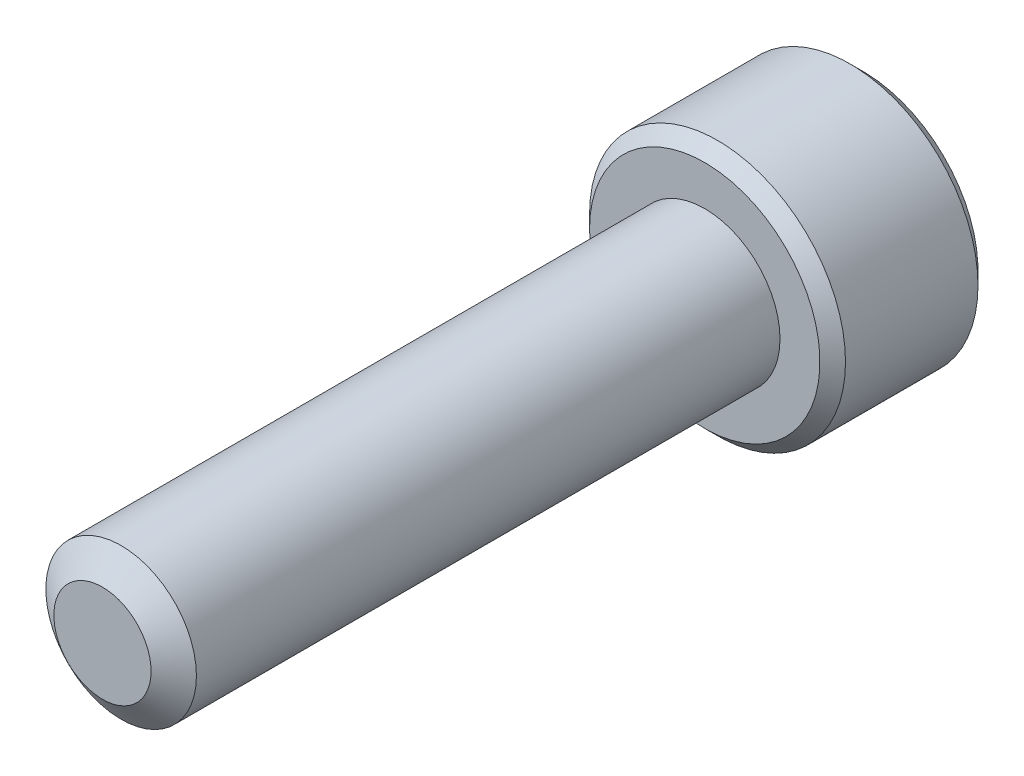
ISO-10303-21;
HEADER;
FILE_DESCRIPTION(('STEP AP214'),'2;1');
FILE_NAME('part.step','',(''),(''),'','','');
FILE_SCHEMA(('AUTOMOTIVE_DESIGN { 1 0 10303 214 1 1 1 1 }'));
ENDSEC;
DATA;
#1=APPLICATION_CONTEXT('core data for automotive mechanical design processes');
#2=APPLICATION_PROTOCOL_DEFINITION('international standard','automotive_design',2000,#1);
#3=PRODUCT_CONTEXT('',#1,'mechanical');
#4=PRODUCT('Part','Part','',(#3));
#5=PRODUCT_RELATED_PRODUCT_CATEGORY('part','',(#4));
#6=PRODUCT_DEFINITION_FORMATION('','',#4);
#7=PRODUCT_DEFINITION_CONTEXT('part definition',#1,'design');
#8=PRODUCT_DEFINITION('design','',#6,#7);
#9=PRODUCT_DEFINITION_SHAPE('','',#8);
#10=(LENGTH_UNIT() NAMED_UNIT(*) SI_UNIT(.MILLI.,.METRE.));
#11=(NAMED_UNIT(*) PLANE_ANGLE_UNIT() SI_UNIT($,.RADIAN.));
#12=(NAMED_UNIT(*) SI_UNIT($,.STERADIAN.) SOLID_ANGLE_UNIT());
#13=UNCERTAINTY_MEASURE_WITH_UNIT(LENGTH_MEASURE(1.E-05),#10,'distance_accuracy_value','');
#14=(GEOMETRIC_REPRESENTATION_CONTEXT(3) GLOBAL_UNCERTAINTY_ASSIGNED_CONTEXT((#13)) GLOBAL_UNIT_ASSIGNED_CONTEXT((#10,
#11,#12)) REPRESENTATION_CONTEXT('',''));
#15=CARTESIAN_POINT('',(0.,0.,0.));
#16=DIRECTION('',(0.,0.,1.));
#17=DIRECTION('',(1.,0.,0.));
#18=AXIS2_PLACEMENT_3D('',#15,#16,#17);
#19=CARTESIAN_POINT('',(0.,0.,-16.));
#20=DIRECTION('',(0.,0.,1.));
#21=DIRECTION('',(1.,0.,0.));
#22=AXIS2_PLACEMENT_3D('',#19,#20,#21);
#23=CYLINDRICAL_SURFACE('',#22,2.);
#24=CARTESIAN_POINT('',(0.,0.,-16.));
#25=DIRECTION('',(0.,0.,-1.));
#26=DIRECTION('',(-1.,0.,0.));
#27=AXIS2_PLACEMENT_3D('',#24,#25,#26);
#28=CIRCLE('',#27,2.);
#29=CARTESIAN_POINT('',(-2.,0.,-16.));
#30=VERTEX_POINT('',#29);
#31=EDGE_CURVE('E231',#30,#30,#28,.F.);
#32=ORIENTED_EDGE('',*,*,#31,.T.);
#33=EDGE_LOOP('',(#32));
#34=FACE_BOUND('',#33,.T.);
#35=CARTESIAN_POINT('',(0.,0.,-0.496211410611025));
#36=DIRECTION('',(0.,0.,1.));
#37=DIRECTION('',(1.,0.,0.));
#38=AXIS2_PLACEMENT_3D('',#35,#36,#37);
#39=CIRCLE('',#38,2.);
#40=CARTESIAN_POINT('',(2.,0.,-0.496211410611025));
#41=VERTEX_POINT('',#40);
#42=EDGE_CURVE('E116',#41,#41,#39,.T.);
#43=ORIENTED_EDGE('',*,*,#42,.F.);
#44=EDGE_LOOP('',(#43));
#45=FACE_BOUND('',#44,.T.);
#46=ADVANCED_FACE('F39',(#34,#45),#23,.T.);
#47=CARTESIAN_POINT('',(0.,0.,0.));
#48=DIRECTION('',(0.,0.,-1.));
#49=DIRECTION('',(-1.,0.,0.));
#50=AXIS2_PLACEMENT_3D('',#47,#48,#49);
#51=CONICAL_SURFACE('',#50,1.29133666301317,0.959931088596884);
#52=ORIENTED_EDGE('',*,*,#42,.T.);
#53=EDGE_LOOP('',(#52));
#54=FACE_BOUND('',#53,.T.);
#55=CARTESIAN_POINT('',(0.,0.,0.));
#56=DIRECTION('',(0.,0.,1.));
#57=DIRECTION('',(1.,0.,0.));
#58=AXIS2_PLACEMENT_3D('',#55,#56,#57);
#59=CIRCLE('',#58,1.29133666301317);
#60=CARTESIAN_POINT('',(1.29133666301317,0.,0.));
#61=VERTEX_POINT('',#60);
#62=EDGE_CURVE('E228',#61,#61,#59,.T.);
#63=ORIENTED_EDGE('',*,*,#62,.F.);
#64=EDGE_LOOP('',(#63));
#65=FACE_BOUND('',#64,.T.);
#66=ADVANCED_FACE('F211',(#54,#65),#51,.T.);
#67=CARTESIAN_POINT('',(0.,0.,0.));
#68=DIRECTION('',(0.,0.,1.));
#69=DIRECTION('',(1.,0.,0.));
#70=AXIS2_PLACEMENT_3D('',#67,#68,#69);
#71=PLANE('',#70);
#72=ORIENTED_EDGE('',*,*,#62,.T.);
#73=EDGE_LOOP('',(#72));
#74=FACE_BOUND('',#73,.T.);
#75=ADVANCED_FACE('F208',(#74),#71,.T.);
#76=CARTESIAN_POINT('',(0.,0.,-20.2));
#77=DIRECTION('',(0.,0.,1.));
#78=DIRECTION('',(1.,0.,0.));
#79=AXIS2_PLACEMENT_3D('',#76,#77,#78);
#80=CYLINDRICAL_SURFACE('',#79,3.4);
#81=CARTESIAN_POINT('',(0.,0.,-19.86));
#82=DIRECTION('',(0.,0.,-1.));
#83=DIRECTION('',(-1.,0.,0.));
#84=AXIS2_PLACEMENT_3D('',#81,#82,#83);
#85=CIRCLE('',#84,3.4);
#86=CARTESIAN_POINT('',(-3.4,0.,-19.86));
#87=VERTEX_POINT('',#86);
#88=EDGE_CURVE('E48',#87,#87,#85,.F.);
#89=ORIENTED_EDGE('',*,*,#88,.T.);
#90=EDGE_LOOP('',(#89));
#91=FACE_BOUND('',#90,.T.);
#92=CARTESIAN_POINT('',(0.,0.,-16.34));
#93=DIRECTION('',(0.,0.,-1.));
#94=DIRECTION('',(-1.,0.,0.));
#95=AXIS2_PLACEMENT_3D('',#92,#93,#94);
#96=CIRCLE('',#95,3.4);
#97=CARTESIAN_POINT('',(-3.4,0.,-16.34));
#98=VERTEX_POINT('',#97);
#99=EDGE_CURVE('E185',#98,#98,#96,.T.);
#100=ORIENTED_EDGE('',*,*,#99,.T.);
#101=EDGE_LOOP('',(#100));
#102=FACE_BOUND('',#101,.T.);
#103=ADVANCED_FACE('F192',(#91,#102),#80,.T.);
#104=CARTESIAN_POINT('',(0.,0.,-20.2));
#105=DIRECTION('',(0.,0.,-1.));
#106=DIRECTION('',(-1.,0.,0.));
#107=AXIS2_PLACEMENT_3D('',#104,#105,#106);
#108=PLANE('',#107);
#109=CARTESIAN_POINT('',(0.,0.,-20.2));
#110=DIRECTION('',(0.,0.,-1.));
#111=DIRECTION('',(-1.,0.,0.));
#112=AXIS2_PLACEMENT_3D('',#109,#110,#111);
#113=CIRCLE('',#112,3.06);
#114=CARTESIAN_POINT('',(-3.06,0.,-20.2));
#115=VERTEX_POINT('',#114);
#116=EDGE_CURVE('E115',#115,#115,#113,.T.);
#117=ORIENTED_EDGE('',*,*,#116,.T.);
#118=EDGE_LOOP('',(#117));
#119=FACE_BOUND('',#118,.T.);
#120=CARTESIAN_POINT('',(0.,0.,-20.2));
#121=DIRECTION('',(0.,0.,-1.));
#122=DIRECTION('',(-1.,0.,0.));
#123=AXIS2_PLACEMENT_3D('',#120,#121,#122);
#124=CIRCLE('',#123,2.06222299276169);
#125=CARTESIAN_POINT('',(-1.7859375,1.03111149638085,-20.2));
#126=VERTEX_POINT('',#125);
#127=CARTESIAN_POINT('',(0.,2.06222299276169,-20.2));
#128=VERTEX_POINT('',#127);
#129=EDGE_CURVE('E94',#126,#128,#124,.T.);
#130=ORIENTED_EDGE('',*,*,#129,.F.);
#131=CARTESIAN_POINT('',(-1.7859375,-1.03111149638085,-20.2));
#132=VERTEX_POINT('',#131);
#133=EDGE_CURVE('E54',#132,#126,#124,.T.);
#134=ORIENTED_EDGE('',*,*,#133,.F.);
#135=CARTESIAN_POINT('',(0.,-2.06222299276169,-20.2));
#136=VERTEX_POINT('',#135);
#137=EDGE_CURVE('E304',#136,#132,#124,.T.);
#138=ORIENTED_EDGE('',*,*,#137,.F.);
#139=CARTESIAN_POINT('',(1.7859375,-1.03111149638085,-20.2));
#140=VERTEX_POINT('',#139);
#141=EDGE_CURVE('E61',#140,#136,#124,.T.);
#142=ORIENTED_EDGE('',*,*,#141,.F.);
#143=CARTESIAN_POINT('',(1.7859375,1.03111149638085,-20.2));
#144=VERTEX_POINT('',#143);
#145=EDGE_CURVE('E139',#144,#140,#124,.T.);
#146=ORIENTED_EDGE('',*,*,#145,.F.);
#147=EDGE_CURVE('E104',#128,#144,#124,.T.);
#148=ORIENTED_EDGE('',*,*,#147,.F.);
#149=EDGE_LOOP('',(#130,#134,#138,#142,#146,#148));
#150=FACE_BOUND('',#149,.T.);
#151=ADVANCED_FACE('F138',(#119,#150),#108,.T.);
#152=CARTESIAN_POINT('',(0.,0.,-16.));
#153=DIRECTION('',(0.,0.,-1.));
#154=DIRECTION('',(-1.,0.,0.));
#155=AXIS2_PLACEMENT_3D('',#152,#153,#154);
#156=PLANE('',#155);
#157=CARTESIAN_POINT('',(0.,0.,-16.));
#158=DIRECTION('',(0.,0.,-1.));
#159=DIRECTION('',(-1.,0.,0.));
#160=AXIS2_PLACEMENT_3D('',#157,#158,#159);
#161=CIRCLE('',#160,3.06);
#162=CARTESIAN_POINT('',(-3.06,0.,-16.));
#163=VERTEX_POINT('',#162);
#164=EDGE_CURVE('E11',#163,#163,#161,.F.);
#165=ORIENTED_EDGE('',*,*,#164,.T.);
#166=EDGE_LOOP('',(#165));
#167=FACE_BOUND('',#166,.T.);
#168=ORIENTED_EDGE('',*,*,#31,.F.);
#169=EDGE_LOOP('',(#168));
#170=FACE_BOUND('',#169,.T.);
#171=ADVANCED_FACE('F201',(#167,#170),#156,.F.);
#172=CARTESIAN_POINT('',(0.,0.,-20.2));
#173=DIRECTION('',(0.,0.,-1.));
#174=DIRECTION('',(-1.,0.,0.));
#175=AXIS2_PLACEMENT_3D('',#172,#173,#174);
#176=CONICAL_SURFACE('',#175,2.06222299276169,0.78539816339745);
#177=ORIENTED_EDGE('',*,*,#147,.T.);
#178=CARTESIAN_POINT('',(-0.000200000000000017,2.06233846281553,-20.2001154797516));
#179=CARTESIAN_POINT('',(0.0611956015759164,2.02689169571862,-20.1646968302053));
#180=CARTESIAN_POINT('',(0.123617860874082,1.9908521875094,-20.1313581781509));
#181=CARTESIAN_POINT('',(0.250903960535891,1.91736352360555,-20.0703155592055));
#182=CARTESIAN_POINT('',(0.315779909798269,1.87990737683499,-20.0426455621251));
#183=CARTESIAN_POINT('',(0.446599209311714,1.8043788190457,-19.9952461265528));
#184=CARTESIAN_POINT('',(0.512509233513534,1.76632564883049,-19.9753975342861));
#185=CARTESIAN_POINT('',(0.645780477682402,1.68938146013435,-19.9448164816143));
#186=CARTESIAN_POINT('',(0.713137624857635,1.65049279308089,-19.9340611886412));
#187=CARTESIAN_POINT('',(0.829220820670577,1.58347212872989,-19.9243572559589));
#188=CARTESIAN_POINT('',(0.877796848686671,1.55542674587864,-19.922920545453));
#189=CARTESIAN_POINT('',(0.974869540343765,1.49938180121945,-19.9253394477888));
#190=CARTESIAN_POINT('',(1.02336617019129,1.4713822589222,-19.9291969161715));
#191=CARTESIAN_POINT('',(1.11988817846821,1.4156552514608,-19.9419828827439));
#192=CARTESIAN_POINT('',(1.16791312509815,1.38792803559618,-19.9509156537155));
#193=CARTESIAN_POINT('',(1.26315922323818,1.33293767519577,-19.9733673141422));
#194=CARTESIAN_POINT('',(1.31037998091306,1.30567475804084,-19.986888386438));
#195=CARTESIAN_POINT('',(1.43132294865621,1.23584830305774,-20.0270273746341));
#196=CARTESIAN_POINT('',(1.50429529371242,1.19371769999614,-20.0566707839069));
#197=CARTESIAN_POINT('',(1.61159442773943,1.13176851608183,-20.106713490254));
#198=CARTESIAN_POINT('',(1.64695424171411,1.11135351796506,-20.124296283774));
#199=CARTESIAN_POINT('',(1.71701878052223,1.07090173762354,-20.1610647691481));
#200=CARTESIAN_POINT('',(1.75172389195438,1.05086473219594,-20.180249476289));
#201=CARTESIAN_POINT('',(1.7861375,1.03099602632701,-20.2001154797516));
#202=B_SPLINE_CURVE_WITH_KNOTS('',3,(#178,#179,#180,#181,#182,#183,#184,#185,#186,#187,#188,
#189,#190,#191,#192,#193,#194,#195,#196,#197,#198,#199,#200,#201),.UNSPECIFIED.,.F.,.F.,(4,2,2,
2,2,2,2,2,2,2,2,4),(0.,0.237911140423802,0.47720876767363,0.712705150046278,0.947608448198473,
1.11569769827263,1.28384587649986,1.45213582505427,1.62050594845156,1.88791495712909,
2.02125696737758,2.15451760593925),.UNSPECIFIED.);
#203=EDGE_CURVE('E109',#128,#144,#202,.T.);
#204=ORIENTED_EDGE('',*,*,#203,.F.);
#205=EDGE_LOOP('',(#177,#204));
#206=FACE_BOUND('',#205,.T.);
#207=ADVANCED_FACE('F110',(#206),#176,.F.);
#208=ORIENTED_EDGE('',*,*,#145,.T.);
#209=CARTESIAN_POINT('',(1.7859375,-2.05645717971961,-20.8614856711608));
#210=CARTESIAN_POINT('',(1.7859375,-2.00638471938943,-20.8236880172129));
#211=CARTESIAN_POINT('',(1.7859375,-1.95603188921789,-20.7862564488772));
#212=CARTESIAN_POINT('',(1.7859375,-1.854654932589,-20.7122876155155));
#213=CARTESIAN_POINT('',(1.7859375,-1.80363064078787,-20.6757505773471));
#214=CARTESIAN_POINT('',(1.7859375,-1.70042696280105,-20.6034731530224));
#215=CARTESIAN_POINT('',(1.7859375,-1.64824168990499,-20.5677411330885));
#216=CARTESIAN_POINT('',(1.7859375,-1.54298521945367,-20.4976166562004));
#217=CARTESIAN_POINT('',(1.7859375,-1.4899140848692,-20.4632241046057));
#218=CARTESIAN_POINT('',(1.7859375,-1.32304925092892,-20.3586275507158));
#219=CARTESIAN_POINT('',(1.7859375,-1.20747518500454,-20.2912130982705));
#220=CARTESIAN_POINT('',(1.7859375,-0.970563462459104,-20.1678971939475));
#221=CARTESIAN_POINT('',(1.7859375,-0.849247003353687,-20.1119569298703));
#222=CARTESIAN_POINT('',(1.7859375,-0.667147590470257,-20.0435193208444));
#223=CARTESIAN_POINT('',(1.7859375,-0.609061868070027,-20.0238772552185));
#224=CARTESIAN_POINT('',(1.7859375,-0.491488306393117,-19.9892564172086));
#225=CARTESIAN_POINT('',(1.7859375,-0.432000370827005,-19.9742779660826));
#226=CARTESIAN_POINT('',(1.7859375,-0.312971553139306,-19.9500118428026));
#227=CARTESIAN_POINT('',(1.7859375,-0.253450864452002,-19.9406266687795));
#228=CARTESIAN_POINT('',(1.7859375,-0.133772958181996,-19.9277303326493));
#229=CARTESIAN_POINT('',(1.7859375,-0.0736158518071977,-19.9242181608107));
#230=CARTESIAN_POINT('',(1.7859375,0.0445641074255747,-19.9233283461957));
#231=CARTESIAN_POINT('',(1.7859375,0.102585397432239,-19.9257332609785));
#232=CARTESIAN_POINT('',(1.7859375,0.218130764089953,-19.9360652894271));
#233=CARTESIAN_POINT('',(1.7859375,0.275654791889439,-19.9439929395484));
#234=CARTESIAN_POINT('',(1.7859375,0.390762936048649,-19.9650721191597));
#235=CARTESIAN_POINT('',(1.7859375,0.448330523980032,-19.9783125455621));
#236=CARTESIAN_POINT('',(1.7859375,0.562208055055495,-20.0093135632103));
#237=CARTESIAN_POINT('',(1.7859375,0.618518103002872,-20.0270737762366));
#238=CARTESIAN_POINT('',(1.7859375,0.795802935191589,-20.089671013407));
#239=CARTESIAN_POINT('',(1.7859375,0.914253068018173,-20.1416371699997));
#240=CARTESIAN_POINT('',(1.7859375,1.14559793282046,-20.2571773027346));
#241=CARTESIAN_POINT('',(1.7859375,1.25847079403571,-20.3207929821984));
#242=CARTESIAN_POINT('',(1.7859375,1.42161019146453,-20.4200649971533));
#243=CARTESIAN_POINT('',(1.7859375,1.47364444123306,-20.452872846234));
#244=CARTESIAN_POINT('',(1.7859375,1.57681993798567,-20.5198743666382));
#245=CARTESIAN_POINT('',(1.7859375,1.62796111690802,-20.5540681429306));
#246=CARTESIAN_POINT('',(1.7859375,1.72905230722622,-20.6233049276337));
#247=CARTESIAN_POINT('',(1.7859375,1.77900862006445,-20.6583387813497));
#248=CARTESIAN_POINT('',(1.7859375,1.87823853588125,-20.7293329710938));
#249=CARTESIAN_POINT('',(1.7859375,1.92751232282623,-20.7652930496911));
#250=CARTESIAN_POINT('',(1.7859375,1.97650034081905,-20.8016325497113));
#251=B_SPLINE_CURVE_WITH_KNOTS('',3,(#209,#210,#211,#212,#213,#214,#215,#216,#217,#218,#219,
#220,#221,#222,#223,#224,#225,#226,#227,#228,#229,#230,#231,#232,#233,#234,#235,#236,#237,#238,
#239,#240,#241,#242,#243,#244,#245,#246,#247,#248,#249,#250),.UNSPECIFIED.,.F.,.F.,(4,2,2,2,2,2,
2,2,2,2,2,2,2,2,2,2,2,2,2,2,4),(0.,0.188213463043315,0.376474173692574,0.566193582088363,
0.755899561378739,1.15694956027169,1.5566197572228,1.74041450803663,1.92422191694645,
2.10472361587529,2.28519427838217,2.45913267081537,2.633087961252,2.8100841940478,
2.98706562052293,3.37397665721653,3.76230085299647,3.94682415443018,4.13136145771436,
4.31439974217306,4.49738769134445),.UNSPECIFIED.);
#252=EDGE_CURVE('E103',#144,#140,#251,.F.);
#253=ORIENTED_EDGE('',*,*,#252,.F.);
#254=EDGE_LOOP('',(#208,#253));
#255=FACE_BOUND('',#254,.T.);
#256=ADVANCED_FACE('F315',(#255),#176,.F.);
#257=ORIENTED_EDGE('',*,*,#141,.T.);
#258=CARTESIAN_POINT('',(1.7861375,-1.03099602632701,-20.2001154797516));
#259=CARTESIAN_POINT('',(1.72474189842408,-1.06644279342392,-20.1646968302053));
#260=CARTESIAN_POINT('',(1.66231963912592,-1.10248230163314,-20.1313581781509));
#261=CARTESIAN_POINT('',(1.53503353946411,-1.17597096553699,-20.0703155592055));
#262=CARTESIAN_POINT('',(1.47015759020173,-1.21342711230755,-20.0426455621251));
#263=CARTESIAN_POINT('',(1.33933829068829,-1.28895567009684,-19.9952461265528));
#264=CARTESIAN_POINT('',(1.27342826648647,-1.32700884031206,-19.9753975342861));
#265=CARTESIAN_POINT('',(1.1401570223176,-1.40395302900819,-19.9448164816143));
#266=CARTESIAN_POINT('',(1.07279987514236,-1.44284169606165,-19.9340611886412));
#267=CARTESIAN_POINT('',(0.956716679329422,-1.50986236041265,-19.9243572559589));
#268=CARTESIAN_POINT('',(0.908140651313328,-1.5379077432639,-19.922920545453));
#269=CARTESIAN_POINT('',(0.811067959656235,-1.59395268792309,-19.9253394477888));
#270=CARTESIAN_POINT('',(0.762571329808711,-1.62195223022034,-19.9291969161715));
#271=CARTESIAN_POINT('',(0.666049321531794,-1.67767923768175,-19.9419828827439));
#272=CARTESIAN_POINT('',(0.618024374901854,-1.70540645354636,-19.9509156537155));
#273=CARTESIAN_POINT('',(0.522778276761815,-1.76039681394677,-19.9733673141422));
#274=CARTESIAN_POINT('',(0.475557519086937,-1.7876597311017,-19.986888386438));
#275=CARTESIAN_POINT('',(0.35461455134379,-1.8574861860848,-20.0270273746341));
#276=CARTESIAN_POINT('',(0.281642206287577,-1.8996167891464,-20.0566707839069));
#277=CARTESIAN_POINT('',(0.174343072260569,-1.96156597306071,-20.106713490254));
#278=CARTESIAN_POINT('',(0.138983258285892,-1.98198097117748,-20.124296283774));
#279=CARTESIAN_POINT('',(0.0689187194777746,-2.022432751519,-20.1610647691481));
#280=CARTESIAN_POINT('',(0.0342136080456217,-2.04246975694661,-20.180249476289));
#281=CARTESIAN_POINT('',(-0.000199999999999263,-2.06233846281553,-20.2001154797516));
#282=B_SPLINE_CURVE_WITH_KNOTS('',3,(#258,#259,#260,#261,#262,#263,#264,#265,#266,#267,#268,
#269,#270,#271,#272,#273,#274,#275,#276,#277,#278,#279,#280,#281),.UNSPECIFIED.,.F.,.F.,(4,2,2,
2,2,2,2,2,2,2,2,4),(0.,0.2379111404238,0.477208767673628,0.712705150046278,0.947608448198473,
1.11569769827263,1.28384587649986,1.45213582505427,1.62050594845156,1.88791495712909,
2.02125696737758,2.15451760593925),.UNSPECIFIED.);
#283=EDGE_CURVE('E152',#140,#136,#282,.T.);
#284=ORIENTED_EDGE('',*,*,#283,.F.);
#285=EDGE_LOOP('',(#257,#284));
#286=FACE_BOUND('',#285,.T.);
#287=ADVANCED_FACE('F312',(#286),#176,.F.);
#288=ORIENTED_EDGE('',*,*,#137,.T.);
#289=CARTESIAN_POINT('',(0.000200000000000694,-2.06233846281553,-20.2001154797516));
#290=CARTESIAN_POINT('',(-0.0611956015759154,-2.02689169571862,-20.1646968302053));
#291=CARTESIAN_POINT('',(-0.123617860874082,-1.9908521875094,-20.1313581781509));
#292=CARTESIAN_POINT('',(-0.25090396053589,-1.91736352360555,-20.0703155592055));
#293=CARTESIAN_POINT('',(-0.315779909798268,-1.87990737683499,-20.0426455621251));
#294=CARTESIAN_POINT('',(-0.446599209311713,-1.8043788190457,-19.9952461265528));
#295=CARTESIAN_POINT('',(-0.512509233513533,-1.76632564883049,-19.9753975342861));
#296=CARTESIAN_POINT('',(-0.645780477682401,-1.68938146013435,-19.9448164816143));
#297=CARTESIAN_POINT('',(-0.713137624857635,-1.65049279308089,-19.9340611886412));
#298=CARTESIAN_POINT('',(-0.829220820670577,-1.58347212872989,-19.9243572559589));
#299=CARTESIAN_POINT('',(-0.877796848686671,-1.55542674587864,-19.922920545453));
#300=CARTESIAN_POINT('',(-0.974869540343765,-1.49938180121945,-19.9253394477888));
#301=CARTESIAN_POINT('',(-1.02336617019129,-1.4713822589222,-19.9291969161715));
#302=CARTESIAN_POINT('',(-1.11988817846821,-1.4156552514608,-19.9419828827439));
#303=CARTESIAN_POINT('',(-1.16791312509815,-1.38792803559618,-19.9509156537155));
#304=CARTESIAN_POINT('',(-1.26315922323818,-1.33293767519577,-19.9733673141422));
#305=CARTESIAN_POINT('',(-1.31037998091306,-1.30567475804084,-19.986888386438));
#306=CARTESIAN_POINT('',(-1.43132294865621,-1.23584830305774,-20.0270273746341));
#307=CARTESIAN_POINT('',(-1.50429529371242,-1.19371769999614,-20.0566707839069));
#308=CARTESIAN_POINT('',(-1.61159442773943,-1.13176851608183,-20.106713490254));
#309=CARTESIAN_POINT('',(-1.64695424171411,-1.11135351796506,-20.124296283774));
#310=CARTESIAN_POINT('',(-1.71701878052222,-1.07090173762354,-20.1610647691481));
#311=CARTESIAN_POINT('',(-1.75172389195438,-1.05086473219594,-20.180249476289));
#312=CARTESIAN_POINT('',(-1.7861375,-1.03099602632701,-20.2001154797516));
#313=B_SPLINE_CURVE_WITH_KNOTS('',3,(#289,#290,#291,#292,#293,#294,#295,#296,#297,#298,#299,
#300,#301,#302,#303,#304,#305,#306,#307,#308,#309,#310,#311,#312),.UNSPECIFIED.,.F.,.F.,(4,2,2,
2,2,2,2,2,2,2,2,4),(0.,0.237911140423801,0.477208767673629,0.712705150046279,0.947608448198474,
1.11569769827263,1.28384587649986,1.45213582505427,1.62050594845156,1.88791495712909,
2.02125696737758,2.15451760593925),.UNSPECIFIED.);
#314=EDGE_CURVE('E281',#136,#132,#313,.T.);
#315=ORIENTED_EDGE('',*,*,#314,.F.);
#316=EDGE_LOOP('',(#288,#315));
#317=FACE_BOUND('',#316,.T.);
#318=ADVANCED_FACE('F309',(#317),#176,.F.);
#319=ORIENTED_EDGE('',*,*,#133,.T.);
#320=CARTESIAN_POINT('',(-1.7859375,-2.0564571797196,-20.8614856711608));
#321=CARTESIAN_POINT('',(-1.7859375,-2.00638471938942,-20.8236880172129));
#322=CARTESIAN_POINT('',(-1.7859375,-1.95603188921789,-20.7862564488772));
#323=CARTESIAN_POINT('',(-1.7859375,-1.854654932589,-20.7122876155155));
#324=CARTESIAN_POINT('',(-1.7859375,-1.80363064078786,-20.6757505773471));
#325=CARTESIAN_POINT('',(-1.7859375,-1.70042696280105,-20.6034731530224));
#326=CARTESIAN_POINT('',(-1.7859375,-1.64824168990499,-20.5677411330885));
#327=CARTESIAN_POINT('',(-1.7859375,-1.54298521945367,-20.4976166562004));
#328=CARTESIAN_POINT('',(-1.7859375,-1.4899140848692,-20.4632241046057));
#329=CARTESIAN_POINT('',(-1.7859375,-1.32304925092892,-20.3586275507158));
#330=CARTESIAN_POINT('',(-1.7859375,-1.20747518500454,-20.2912130982705));
#331=CARTESIAN_POINT('',(-1.7859375,-0.970563462459105,-20.1678971939475));
#332=CARTESIAN_POINT('',(-1.7859375,-0.849247003353687,-20.1119569298703));
#333=CARTESIAN_POINT('',(-1.7859375,-0.667147590470258,-20.0435193208444));
#334=CARTESIAN_POINT('',(-1.7859375,-0.609061868070027,-20.0238772552185));
#335=CARTESIAN_POINT('',(-1.7859375,-0.491488306393118,-19.9892564172086));
#336=CARTESIAN_POINT('',(-1.7859375,-0.432000370827006,-19.9742779660826));
#337=CARTESIAN_POINT('',(-1.7859375,-0.312971553139305,-19.9500118428026));
#338=CARTESIAN_POINT('',(-1.7859375,-0.253450864452002,-19.9406266687795));
#339=CARTESIAN_POINT('',(-1.7859375,-0.133772958181996,-19.9277303326493));
#340=CARTESIAN_POINT('',(-1.7859375,-0.0736158518071967,-19.9242181608107));
#341=CARTESIAN_POINT('',(-1.7859375,0.0445641074255758,-19.9233283461957));
#342=CARTESIAN_POINT('',(-1.7859375,0.10258539743224,-19.9257332609785));
#343=CARTESIAN_POINT('',(-1.7859375,0.218130764089954,-19.9360652894271));
#344=CARTESIAN_POINT('',(-1.7859375,0.27565479188944,-19.9439929395484));
#345=CARTESIAN_POINT('',(-1.7859375,0.390762936048649,-19.9650721191597));
#346=CARTESIAN_POINT('',(-1.7859375,0.448330523980032,-19.9783125455621));
#347=CARTESIAN_POINT('',(-1.7859375,0.562208055055494,-20.0093135632103));
#348=CARTESIAN_POINT('',(-1.7859375,0.618518103002873,-20.0270737762366));
#349=CARTESIAN_POINT('',(-1.7859375,0.795802935191591,-20.089671013407));
#350=CARTESIAN_POINT('',(-1.7859375,0.914253068018176,-20.1416371699997));
#351=CARTESIAN_POINT('',(-1.7859375,1.14559793282046,-20.2571773027346));
#352=CARTESIAN_POINT('',(-1.7859375,1.25847079403571,-20.3207929821984));
#353=CARTESIAN_POINT('',(-1.7859375,1.42161019146454,-20.4200649971533));
#354=CARTESIAN_POINT('',(-1.7859375,1.47364444123306,-20.452872846234));
#355=CARTESIAN_POINT('',(-1.7859375,1.57681993798568,-20.5198743666382));
#356=CARTESIAN_POINT('',(-1.7859375,1.62796111690803,-20.5540681429306));
#357=CARTESIAN_POINT('',(-1.7859375,1.72905230722623,-20.6233049276337));
#358=CARTESIAN_POINT('',(-1.7859375,1.77900862006446,-20.6583387813497));
#359=CARTESIAN_POINT('',(-1.7859375,1.87823853588126,-20.7293329710938));
#360=CARTESIAN_POINT('',(-1.7859375,1.92751232282623,-20.7652930496911));
#361=CARTESIAN_POINT('',(-1.7859375,1.97650034081906,-20.8016325497113));
#362=B_SPLINE_CURVE_WITH_KNOTS('',3,(#320,#321,#322,#323,#324,#325,#326,#327,#328,#329,#330,
#331,#332,#333,#334,#335,#336,#337,#338,#339,#340,#341,#342,#343,#344,#345,#346,#347,#348,#349,
#350,#351,#352,#353,#354,#355,#356,#357,#358,#359,#360,#361),.UNSPECIFIED.,.F.,.F.,(4,2,2,2,2,2,
2,2,2,2,2,2,2,2,2,2,2,2,2,2,4),(0.,0.188213463043315,0.376474173692572,0.566193582088364,
0.755899561378737,1.15694956027169,1.5566197572228,1.74041450803663,1.92422191694645,
2.10472361587529,2.28519427838216,2.45913267081537,2.63308796125199,2.8100841940478,
2.98706562052292,3.37397665721653,3.76230085299647,3.94682415443018,4.13136145771436,
4.31439974217306,4.49738769134445),.UNSPECIFIED.);
#363=EDGE_CURVE('E127',#132,#126,#362,.T.);
#364=ORIENTED_EDGE('',*,*,#363,.F.);
#365=EDGE_LOOP('',(#319,#364));
#366=FACE_BOUND('',#365,.T.);
#367=ADVANCED_FACE('F324',(#366),#176,.F.);
#368=ORIENTED_EDGE('',*,*,#129,.T.);
#369=CARTESIAN_POINT('',(-1.7861375,1.03099602632701,-20.2001154797516));
#370=CARTESIAN_POINT('',(-1.72474189842408,1.06644279342392,-20.1646968302053));
#371=CARTESIAN_POINT('',(-1.66231963912592,1.10248230163315,-20.1313581781509));
#372=CARTESIAN_POINT('',(-1.53503353946411,1.17597096553699,-20.0703155592055));
#373=CARTESIAN_POINT('',(-1.47015759020173,1.21342711230755,-20.0426455621251));
#374=CARTESIAN_POINT('',(-1.33933829068828,1.28895567009684,-19.9952461265528));
#375=CARTESIAN_POINT('',(-1.27342826648647,1.32700884031206,-19.9753975342861));
#376=CARTESIAN_POINT('',(-1.1401570223176,1.40395302900819,-19.9448164816143));
#377=CARTESIAN_POINT('',(-1.07279987514236,1.44284169606165,-19.9340611886412));
#378=CARTESIAN_POINT('',(-0.956716679329422,1.50986236041265,-19.9243572559589));
#379=CARTESIAN_POINT('',(-0.908140651313328,1.5379077432639,-19.922920545453));
#380=CARTESIAN_POINT('',(-0.811067959656234,1.59395268792309,-19.9253394477888));
#381=CARTESIAN_POINT('',(-0.76257132980871,1.62195223022034,-19.9291969161715));
#382=CARTESIAN_POINT('',(-0.666049321531794,1.67767923768175,-19.9419828827439));
#383=CARTESIAN_POINT('',(-0.618024374901853,1.70540645354636,-19.9509156537155));
#384=CARTESIAN_POINT('',(-0.522778276761815,1.76039681394677,-19.9733673141422));
#385=CARTESIAN_POINT('',(-0.475557519086937,1.7876597311017,-19.986888386438));
#386=CARTESIAN_POINT('',(-0.35461455134379,1.8574861860848,-20.0270273746341));
#387=CARTESIAN_POINT('',(-0.281642206287578,1.8996167891464,-20.0566707839069));
#388=CARTESIAN_POINT('',(-0.174343072260569,1.96156597306071,-20.106713490254));
#389=CARTESIAN_POINT('',(-0.138983258285892,1.98198097117748,-20.124296283774));
#390=CARTESIAN_POINT('',(-0.0689187194777743,2.022432751519,-20.1610647691481));
#391=CARTESIAN_POINT('',(-0.0342136080456209,2.04246975694661,-20.180249476289));
#392=CARTESIAN_POINT('',(0.000199999999999966,2.06233846281553,-20.2001154797516));
#393=B_SPLINE_CURVE_WITH_KNOTS('',3,(#369,#370,#371,#372,#373,#374,#375,#376,#377,#378,#379,
#380,#381,#382,#383,#384,#385,#386,#387,#388,#389,#390,#391,#392),.UNSPECIFIED.,.F.,.F.,(4,2,2,
2,2,2,2,2,2,2,2,4),(0.,0.237911140423802,0.47720876767363,0.712705150046277,0.947608448198473,
1.11569769827263,1.28384587649986,1.45213582505427,1.62050594845156,1.88791495712909,
2.02125696737758,2.15451760593925),.UNSPECIFIED.);
#394=EDGE_CURVE('E98',#126,#128,#393,.T.);
#395=ORIENTED_EDGE('',*,*,#394,.F.);
#396=EDGE_LOOP('',(#368,#395));
#397=FACE_BOUND('',#396,.T.);
#398=ADVANCED_FACE('F96',(#397),#176,.F.);
#399=CARTESIAN_POINT('',(1.7859375,3.09333448914254,-17.52109375));
#400=DIRECTION('',(0.,0.,-1.));
#401=DIRECTION('',(-1.,0.,0.));
#402=AXIS2_PLACEMENT_3D('',#399,#400,#401);
#403=PLANE('',#402);
#404=DIRECTION('',(0.866025403784439,0.5,0.));
#405=VECTOR('',#404,1.);
#406=CARTESIAN_POINT('',(-1.7859375,1.03111149638085,-17.52109375));
#407=LINE('',#406,#405);
#408=CARTESIAN_POINT('',(-1.7859375,1.03111149638085,-17.52109375));
#409=VERTEX_POINT('',#408);
#410=CARTESIAN_POINT('',(0.,2.06222299276169,-17.52109375));
#411=VERTEX_POINT('',#410);
#412=EDGE_CURVE('E126',#409,#411,#407,.T.);
#413=ORIENTED_EDGE('',*,*,#412,.T.);
#414=DIRECTION('',(0.866025403784439,-0.5,0.));
#415=VECTOR('',#414,1.);
#416=CARTESIAN_POINT('',(0.,2.06222299276169,-17.52109375));
#417=LINE('',#416,#415);
#418=CARTESIAN_POINT('',(1.7859375,1.03111149638085,-17.52109375));
#419=VERTEX_POINT('',#418);
#420=EDGE_CURVE('E131',#411,#419,#417,.T.);
#421=ORIENTED_EDGE('',*,*,#420,.T.);
#422=DIRECTION('',(0.,-1.,0.));
#423=VECTOR('',#422,1.);
#424=CARTESIAN_POINT('',(1.7859375,1.03111149638085,-17.52109375));
#425=LINE('',#424,#423);
#426=CARTESIAN_POINT('',(1.7859375,-1.03111149638085,-17.52109375));
#427=VERTEX_POINT('',#426);
#428=EDGE_CURVE('E263',#419,#427,#425,.T.);
#429=ORIENTED_EDGE('',*,*,#428,.T.);
#430=DIRECTION('',(-0.866025403784439,-0.5,0.));
#431=VECTOR('',#430,1.);
#432=CARTESIAN_POINT('',(1.7859375,-1.03111149638085,-17.52109375));
#433=LINE('',#432,#431);
#434=CARTESIAN_POINT('',(0.,-2.06222299276169,-17.52109375));
#435=VERTEX_POINT('',#434);
#436=EDGE_CURVE('E259',#427,#435,#433,.T.);
#437=ORIENTED_EDGE('',*,*,#436,.T.);
#438=DIRECTION('',(-0.866025403784439,0.5,0.));
#439=VECTOR('',#438,1.);
#440=CARTESIAN_POINT('',(0.,-2.06222299276169,-17.52109375));
#441=LINE('',#440,#439);
#442=CARTESIAN_POINT('',(-1.7859375,-1.03111149638085,-17.52109375));
#443=VERTEX_POINT('',#442);
#444=EDGE_CURVE('E255',#435,#443,#441,.T.);
#445=ORIENTED_EDGE('',*,*,#444,.T.);
#446=DIRECTION('',(0.,1.,0.));
#447=VECTOR('',#446,1.);
#448=CARTESIAN_POINT('',(-1.7859375,-1.03111149638085,-17.52109375));
#449=LINE('',#448,#447);
#450=EDGE_CURVE('E135',#443,#409,#449,.T.);
#451=ORIENTED_EDGE('',*,*,#450,.T.);
#452=EDGE_LOOP('',(#413,#421,#429,#437,#445,#451));
#453=FACE_BOUND('',#452,.T.);
#454=ADVANCED_FACE('F172',(#453),#403,.T.);
#455=CARTESIAN_POINT('',(0.,2.06222299276169,-17.52109375));
#456=DIRECTION('',(0.5,0.866025403784439,0.));
#457=DIRECTION('',(-0.866025403784439,0.5,0.));
#458=AXIS2_PLACEMENT_3D('',#455,#456,#457);
#459=PLANE('',#458);
#460=DIRECTION('',(0.,0.,-1.));
#461=VECTOR('',#460,1.);
#462=CARTESIAN_POINT('',(0.,2.06222299276169,-17.52109375));
#463=LINE('',#462,#461);
#464=EDGE_CURVE('E122',#411,#128,#463,.T.);
#465=ORIENTED_EDGE('',*,*,#464,.T.);
#466=ORIENTED_EDGE('',*,*,#203,.T.);
#467=DIRECTION('',(0.,0.,-1.));
#468=VECTOR('',#467,1.);
#469=CARTESIAN_POINT('',(1.7859375,1.03111149638085,-17.52109375));
#470=LINE('',#469,#468);
#471=EDGE_CURVE('E134',#419,#144,#470,.T.);
#472=ORIENTED_EDGE('',*,*,#471,.F.);
#473=ORIENTED_EDGE('',*,*,#420,.F.);
#474=EDGE_LOOP('',(#465,#466,#472,#473));
#475=FACE_BOUND('',#474,.T.);
#476=ADVANCED_FACE('F129',(#475),#459,.F.);
#477=CARTESIAN_POINT('',(1.7859375,1.03111149638085,-17.52109375));
#478=DIRECTION('',(1.,0.,0.));
#479=DIRECTION('',(0.,1.,0.));
#480=AXIS2_PLACEMENT_3D('',#477,#478,#479);
#481=PLANE('',#480);
#482=ORIENTED_EDGE('',*,*,#471,.T.);
#483=ORIENTED_EDGE('',*,*,#252,.T.);
#484=DIRECTION('',(0.,0.,-1.));
#485=VECTOR('',#484,1.);
#486=CARTESIAN_POINT('',(1.7859375,-1.03111149638085,-17.52109375));
#487=LINE('',#486,#485);
#488=EDGE_CURVE('E239',#427,#140,#487,.T.);
#489=ORIENTED_EDGE('',*,*,#488,.F.);
#490=ORIENTED_EDGE('',*,*,#428,.F.);
#491=EDGE_LOOP('',(#482,#483,#489,#490));
#492=FACE_BOUND('',#491,.T.);
#493=ADVANCED_FACE('F161',(#492),#481,.F.);
#494=CARTESIAN_POINT('',(1.7859375,-1.03111149638085,-17.52109375));
#495=DIRECTION('',(0.5,-0.866025403784439,0.));
#496=DIRECTION('',(0.866025403784439,0.5,0.));
#497=AXIS2_PLACEMENT_3D('',#494,#495,#496);
#498=PLANE('',#497);
#499=ORIENTED_EDGE('',*,*,#488,.T.);
#500=ORIENTED_EDGE('',*,*,#283,.T.);
#501=DIRECTION('',(0.,0.,-1.));
#502=VECTOR('',#501,1.);
#503=CARTESIAN_POINT('',(0.,-2.06222299276169,-17.52109375));
#504=LINE('',#503,#502);
#505=EDGE_CURVE('E243',#435,#136,#504,.T.);
#506=ORIENTED_EDGE('',*,*,#505,.F.);
#507=ORIENTED_EDGE('',*,*,#436,.F.);
#508=EDGE_LOOP('',(#499,#500,#506,#507));
#509=FACE_BOUND('',#508,.T.);
#510=ADVANCED_FACE('F165',(#509),#498,.F.);
#511=CARTESIAN_POINT('',(0.,-2.06222299276169,-17.52109375));
#512=DIRECTION('',(-0.5,-0.866025403784439,0.));
#513=DIRECTION('',(0.866025403784439,-0.5,0.));
#514=AXIS2_PLACEMENT_3D('',#511,#512,#513);
#515=PLANE('',#514);
#516=ORIENTED_EDGE('',*,*,#505,.T.);
#517=ORIENTED_EDGE('',*,*,#314,.T.);
#518=DIRECTION('',(0.,0.,-1.));
#519=VECTOR('',#518,1.);
#520=CARTESIAN_POINT('',(-1.7859375,-1.03111149638085,-17.52109375));
#521=LINE('',#520,#519);
#522=EDGE_CURVE('E247',#443,#132,#521,.T.);
#523=ORIENTED_EDGE('',*,*,#522,.F.);
#524=ORIENTED_EDGE('',*,*,#444,.F.);
#525=EDGE_LOOP('',(#516,#517,#523,#524));
#526=FACE_BOUND('',#525,.T.);
#527=ADVANCED_FACE('F289',(#526),#515,.F.);
#528=CARTESIAN_POINT('',(-1.7859375,-1.03111149638085,-17.52109375));
#529=DIRECTION('',(-1.,0.,0.));
#530=DIRECTION('',(0.,-1.,0.));
#531=AXIS2_PLACEMENT_3D('',#528,#529,#530);
#532=PLANE('',#531);
#533=ORIENTED_EDGE('',*,*,#522,.T.);
#534=ORIENTED_EDGE('',*,*,#363,.T.);
#535=DIRECTION('',(0.,0.,-1.));
#536=VECTOR('',#535,1.);
#537=CARTESIAN_POINT('',(-1.7859375,1.03111149638085,-17.52109375));
#538=LINE('',#537,#536);
#539=EDGE_CURVE('E124',#409,#126,#538,.T.);
#540=ORIENTED_EDGE('',*,*,#539,.F.);
#541=ORIENTED_EDGE('',*,*,#450,.F.);
#542=EDGE_LOOP('',(#533,#534,#540,#541));
#543=FACE_BOUND('',#542,.T.);
#544=ADVANCED_FACE('F286',(#543),#532,.F.);
#545=CARTESIAN_POINT('',(-1.7859375,1.03111149638085,-17.52109375));
#546=DIRECTION('',(-0.5,0.866025403784439,0.));
#547=DIRECTION('',(-0.866025403784439,-0.5,0.));
#548=AXIS2_PLACEMENT_3D('',#545,#546,#547);
#549=PLANE('',#548);
#550=ORIENTED_EDGE('',*,*,#539,.T.);
#551=ORIENTED_EDGE('',*,*,#394,.T.);
#552=ORIENTED_EDGE('',*,*,#464,.F.);
#553=ORIENTED_EDGE('',*,*,#412,.F.);
#554=EDGE_LOOP('',(#550,#551,#552,#553));
#555=FACE_BOUND('',#554,.T.);
#556=ADVANCED_FACE('F120',(#555),#549,.F.);
#557=CARTESIAN_POINT('',(0.,0.,-20.2));
#558=DIRECTION('',(0.,0.,1.));
#559=DIRECTION('',(1.,0.,0.));
#560=AXIS2_PLACEMENT_3D('',#557,#558,#559);
#561=CONICAL_SURFACE('',#560,3.06,0.785398163397443);
#562=ORIENTED_EDGE('',*,*,#88,.F.);
#563=EDGE_LOOP('',(#562));
#564=FACE_BOUND('',#563,.T.);
#565=ORIENTED_EDGE('',*,*,#116,.F.);
#566=EDGE_LOOP('',(#565));
#567=FACE_BOUND('',#566,.T.);
#568=ADVANCED_FACE('F195',(#564,#567),#561,.T.);
#569=CARTESIAN_POINT('',(0.,0.,-16.34));
#570=DIRECTION('',(0.,0.,-1.));
#571=DIRECTION('',(-1.,0.,0.));
#572=AXIS2_PLACEMENT_3D('',#569,#570,#571);
#573=CONICAL_SURFACE('',#572,3.4,0.785398163397445);
#574=ORIENTED_EDGE('',*,*,#164,.F.);
#575=EDGE_LOOP('',(#574));
#576=FACE_BOUND('',#575,.T.);
#577=ORIENTED_EDGE('',*,*,#99,.F.);
#578=EDGE_LOOP('',(#577));
#579=FACE_BOUND('',#578,.T.);
#580=ADVANCED_FACE('F41',(#576,#579),#573,.T.);
#581=CLOSED_SHELL('',(#46,#66,#75,#103,#151,#171,#207,#256,#287,#318,#367,#398,#454,#476,#493,
#510,#527,#544,#556,#568,#580));
#582=MANIFOLD_SOLID_BREP('B2',#581);
#583=ADVANCED_BREP_SHAPE_REPRESENTATION('',(#18,#582),#14);
#584=SHAPE_DEFINITION_REPRESENTATION(#9,#583);
ENDSEC;
END-ISO-10303-21;
